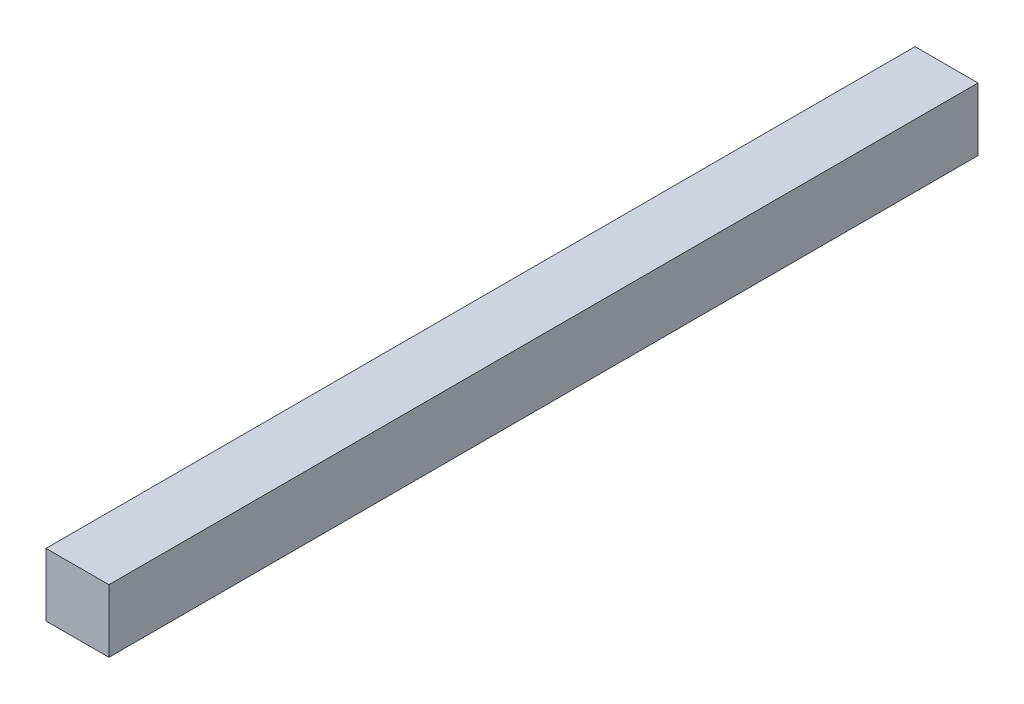
ISO-10303-21;
HEADER;
FILE_DESCRIPTION(('STEP AP214'),'2;1');
FILE_NAME('part.step','',(''),(''),'','','');
FILE_SCHEMA(('AUTOMOTIVE_DESIGN { 1 0 10303 214 1 1 1 1 }'));
ENDSEC;
DATA;
#1=APPLICATION_CONTEXT('core data for automotive mechanical design processes');
#2=APPLICATION_PROTOCOL_DEFINITION('international standard','automotive_design',2000,#1);
#3=PRODUCT_CONTEXT('',#1,'mechanical');
#4=PRODUCT('Part','Part','',(#3));
#5=PRODUCT_RELATED_PRODUCT_CATEGORY('part','',(#4));
#6=PRODUCT_DEFINITION_FORMATION('','',#4);
#7=PRODUCT_DEFINITION_CONTEXT('part definition',#1,'design');
#8=PRODUCT_DEFINITION('design','',#6,#7);
#9=PRODUCT_DEFINITION_SHAPE('','',#8);
#10=(LENGTH_UNIT() NAMED_UNIT(*) SI_UNIT(.MILLI.,.METRE.));
#11=(NAMED_UNIT(*) PLANE_ANGLE_UNIT() SI_UNIT($,.RADIAN.));
#12=(NAMED_UNIT(*) SI_UNIT($,.STERADIAN.) SOLID_ANGLE_UNIT());
#13=UNCERTAINTY_MEASURE_WITH_UNIT(LENGTH_MEASURE(1.E-05),#10,'distance_accuracy_value','');
#14=(GEOMETRIC_REPRESENTATION_CONTEXT(3) GLOBAL_UNCERTAINTY_ASSIGNED_CONTEXT((#13)) GLOBAL_UNIT_ASSIGNED_CONTEXT((#10,
#11,#12)) REPRESENTATION_CONTEXT('',''));
#15=CARTESIAN_POINT('',(0.,0.,0.));
#16=DIRECTION('',(0.,0.,1.));
#17=DIRECTION('',(1.,0.,0.));
#18=AXIS2_PLACEMENT_3D('',#15,#16,#17);
#19=CARTESIAN_POINT('',(0.,-21.,580.));
#20=DIRECTION('',(0.,-1.,0.));
#21=DIRECTION('',(1.,0.,0.));
#22=AXIS2_PLACEMENT_3D('',#19,#20,#21);
#23=PLANE('',#22);
#24=DIRECTION('',(-1.,0.,0.));
#25=VECTOR('',#24,1.);
#26=CARTESIAN_POINT('',(0.,-21.,0.));
#27=LINE('',#26,#25);
#28=CARTESIAN_POINT('',(21.,-21.,0.));
#29=VERTEX_POINT('',#28);
#30=CARTESIAN_POINT('',(-21.,-21.,0.));
#31=VERTEX_POINT('',#30);
#32=EDGE_CURVE('E102',#29,#31,#27,.T.);
#33=ORIENTED_EDGE('',*,*,#32,.F.);
#34=DIRECTION('',(0.,0.,-1.));
#35=VECTOR('',#34,1.);
#36=CARTESIAN_POINT('',(21.,-21.,580.));
#37=LINE('',#36,#35);
#38=CARTESIAN_POINT('',(21.,-21.,580.));
#39=VERTEX_POINT('',#38);
#40=EDGE_CURVE('E11',#39,#29,#37,.T.);
#41=ORIENTED_EDGE('',*,*,#40,.F.);
#42=DIRECTION('',(-1.,0.,0.));
#43=VECTOR('',#42,1.);
#44=CARTESIAN_POINT('',(0.,-21.,580.));
#45=LINE('',#44,#43);
#46=CARTESIAN_POINT('',(-21.,-21.,580.));
#47=VERTEX_POINT('',#46);
#48=EDGE_CURVE('E87',#39,#47,#45,.T.);
#49=ORIENTED_EDGE('',*,*,#48,.T.);
#50=DIRECTION('',(0.,0.,-1.));
#51=VECTOR('',#50,1.);
#52=CARTESIAN_POINT('',(-21.,-21.,580.));
#53=LINE('',#52,#51);
#54=EDGE_CURVE('E55',#47,#31,#53,.T.);
#55=ORIENTED_EDGE('',*,*,#54,.T.);
#56=EDGE_LOOP('',(#33,#41,#49,#55));
#57=FACE_BOUND('',#56,.T.);
#58=ADVANCED_FACE('F39',(#57),#23,.T.);
#59=CARTESIAN_POINT('',(21.,0.,580.));
#60=DIRECTION('',(-1.,0.,0.));
#61=DIRECTION('',(0.,0.,1.));
#62=AXIS2_PLACEMENT_3D('',#59,#60,#61);
#63=PLANE('',#62);
#64=DIRECTION('',(0.,1.,0.));
#65=VECTOR('',#64,1.);
#66=CARTESIAN_POINT('',(21.,0.,0.));
#67=LINE('',#66,#65);
#68=CARTESIAN_POINT('',(21.,21.,0.));
#69=VERTEX_POINT('',#68);
#70=EDGE_CURVE('E93',#29,#69,#67,.T.);
#71=ORIENTED_EDGE('',*,*,#70,.T.);
#72=DIRECTION('',(0.,0.,-1.));
#73=VECTOR('',#72,1.);
#74=CARTESIAN_POINT('',(21.,21.,580.));
#75=LINE('',#74,#73);
#76=CARTESIAN_POINT('',(21.,21.,580.));
#77=VERTEX_POINT('',#76);
#78=EDGE_CURVE('E47',#77,#69,#75,.T.);
#79=ORIENTED_EDGE('',*,*,#78,.F.);
#80=DIRECTION('',(0.,1.,0.));
#81=VECTOR('',#80,1.);
#82=CARTESIAN_POINT('',(21.,0.,580.));
#83=LINE('',#82,#81);
#84=EDGE_CURVE('E81',#39,#77,#83,.T.);
#85=ORIENTED_EDGE('',*,*,#84,.F.);
#86=ORIENTED_EDGE('',*,*,#40,.T.);
#87=EDGE_LOOP('',(#71,#79,#85,#86));
#88=FACE_BOUND('',#87,.T.);
#89=ADVANCED_FACE('F91',(#88),#63,.F.);
#90=CARTESIAN_POINT('',(0.,21.,580.));
#91=DIRECTION('',(0.,-1.,0.));
#92=DIRECTION('',(1.,0.,0.));
#93=AXIS2_PLACEMENT_3D('',#90,#91,#92);
#94=PLANE('',#93);
#95=DIRECTION('',(-1.,0.,0.));
#96=VECTOR('',#95,1.);
#97=CARTESIAN_POINT('',(0.,21.,0.));
#98=LINE('',#97,#96);
#99=CARTESIAN_POINT('',(-21.,21.,0.));
#100=VERTEX_POINT('',#99);
#101=EDGE_CURVE('E105',#69,#100,#98,.T.);
#102=ORIENTED_EDGE('',*,*,#101,.T.);
#103=DIRECTION('',(0.,0.,-1.));
#104=VECTOR('',#103,1.);
#105=CARTESIAN_POINT('',(-21.,21.,580.));
#106=LINE('',#105,#104);
#107=CARTESIAN_POINT('',(-21.,21.,580.));
#108=VERTEX_POINT('',#107);
#109=EDGE_CURVE('E69',#108,#100,#106,.T.);
#110=ORIENTED_EDGE('',*,*,#109,.F.);
#111=DIRECTION('',(-1.,0.,0.));
#112=VECTOR('',#111,1.);
#113=CARTESIAN_POINT('',(0.,21.,580.));
#114=LINE('',#113,#112);
#115=EDGE_CURVE('E86',#77,#108,#114,.T.);
#116=ORIENTED_EDGE('',*,*,#115,.F.);
#117=ORIENTED_EDGE('',*,*,#78,.T.);
#118=EDGE_LOOP('',(#102,#110,#116,#117));
#119=FACE_BOUND('',#118,.T.);
#120=ADVANCED_FACE('F96',(#119),#94,.F.);
#121=CARTESIAN_POINT('',(-21.,0.,580.));
#122=DIRECTION('',(-1.,0.,0.));
#123=DIRECTION('',(0.,0.,1.));
#124=AXIS2_PLACEMENT_3D('',#121,#122,#123);
#125=PLANE('',#124);
#126=DIRECTION('',(0.,1.,0.));
#127=VECTOR('',#126,1.);
#128=CARTESIAN_POINT('',(-21.,0.,0.));
#129=LINE('',#128,#127);
#130=EDGE_CURVE('E107',#31,#100,#129,.T.);
#131=ORIENTED_EDGE('',*,*,#130,.F.);
#132=ORIENTED_EDGE('',*,*,#54,.F.);
#133=DIRECTION('',(0.,1.,0.));
#134=VECTOR('',#133,1.);
#135=CARTESIAN_POINT('',(-21.,0.,580.));
#136=LINE('',#135,#134);
#137=EDGE_CURVE('E97',#47,#108,#136,.T.);
#138=ORIENTED_EDGE('',*,*,#137,.T.);
#139=ORIENTED_EDGE('',*,*,#109,.T.);
#140=EDGE_LOOP('',(#131,#132,#138,#139));
#141=FACE_BOUND('',#140,.T.);
#142=ADVANCED_FACE('F112',(#141),#125,.T.);
#143=CARTESIAN_POINT('',(0.,0.,580.));
#144=DIRECTION('',(0.,0.,1.));
#145=DIRECTION('',(1.,0.,0.));
#146=AXIS2_PLACEMENT_3D('',#143,#144,#145);
#147=PLANE('',#146);
#148=ORIENTED_EDGE('',*,*,#48,.F.);
#149=ORIENTED_EDGE('',*,*,#84,.T.);
#150=ORIENTED_EDGE('',*,*,#115,.T.);
#151=ORIENTED_EDGE('',*,*,#137,.F.);
#152=EDGE_LOOP('',(#148,#149,#150,#151));
#153=FACE_BOUND('',#152,.T.);
#154=ADVANCED_FACE('F83',(#153),#147,.T.);
#155=CARTESIAN_POINT('',(0.,0.,0.));
#156=DIRECTION('',(0.,0.,1.));
#157=DIRECTION('',(1.,0.,0.));
#158=AXIS2_PLACEMENT_3D('',#155,#156,#157);
#159=PLANE('',#158);
#160=ORIENTED_EDGE('',*,*,#32,.T.);
#161=ORIENTED_EDGE('',*,*,#130,.T.);
#162=ORIENTED_EDGE('',*,*,#101,.F.);
#163=ORIENTED_EDGE('',*,*,#70,.F.);
#164=EDGE_LOOP('',(#160,#161,#162,#163));
#165=FACE_BOUND('',#164,.T.);
#166=ADVANCED_FACE('F119',(#165),#159,.F.);
#167=CLOSED_SHELL('',(#58,#89,#120,#142,#154,#166));
#168=MANIFOLD_SOLID_BREP('B2',#167);
#169=ADVANCED_BREP_SHAPE_REPRESENTATION('',(#18,#168),#14);
#170=SHAPE_DEFINITION_REPRESENTATION(#9,#169);
ENDSEC;
END-ISO-10303-21;
